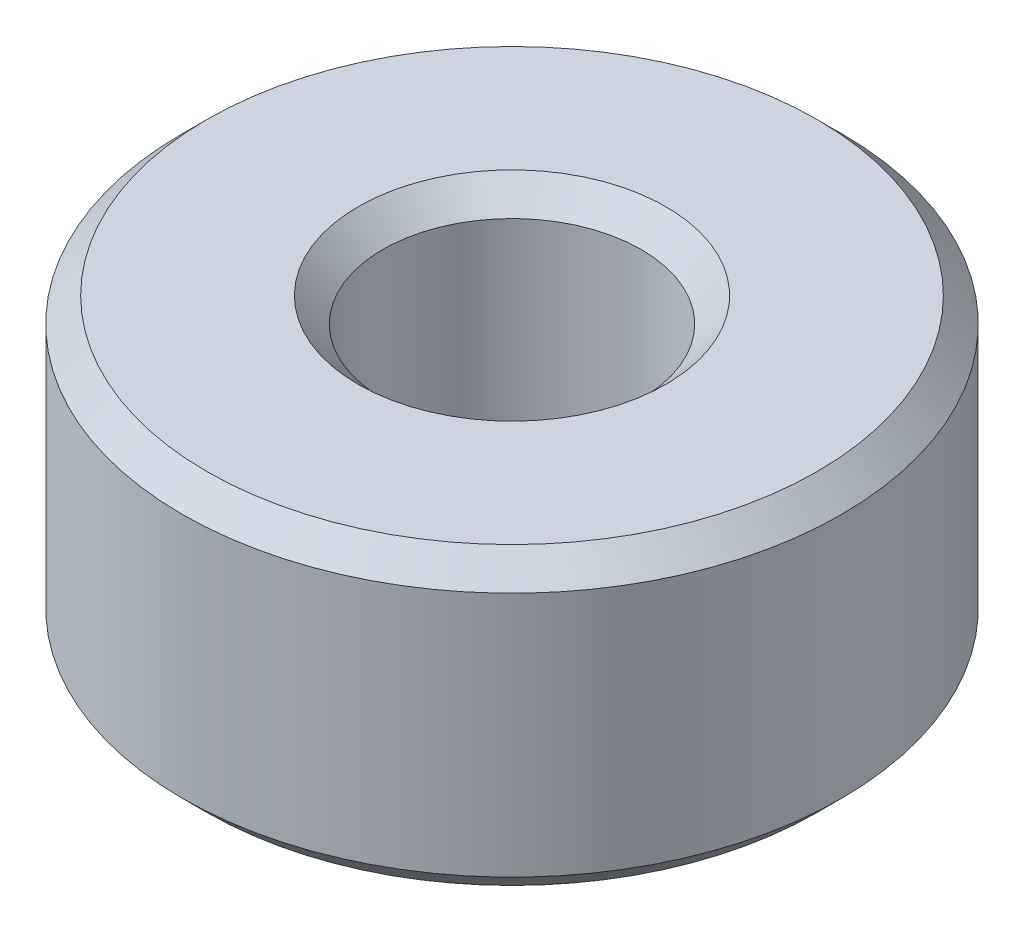
ISO-10303-21;
HEADER;
FILE_DESCRIPTION(('STEP AP214'),'2;1');
FILE_NAME('part.step','',(''),(''),'','','');
FILE_SCHEMA(('AUTOMOTIVE_DESIGN { 1 0 10303 214 1 1 1 1 }'));
ENDSEC;
DATA;
#1=APPLICATION_CONTEXT('core data for automotive mechanical design processes');
#2=APPLICATION_PROTOCOL_DEFINITION('international standard','automotive_design',2000,#1);
#3=PRODUCT_CONTEXT('',#1,'mechanical');
#4=PRODUCT('Part','Part','',(#3));
#5=PRODUCT_RELATED_PRODUCT_CATEGORY('part','',(#4));
#6=PRODUCT_DEFINITION_FORMATION('','',#4);
#7=PRODUCT_DEFINITION_CONTEXT('part definition',#1,'design');
#8=PRODUCT_DEFINITION('design','',#6,#7);
#9=PRODUCT_DEFINITION_SHAPE('','',#8);
#10=(LENGTH_UNIT() NAMED_UNIT(*) SI_UNIT(.MILLI.,.METRE.));
#11=(NAMED_UNIT(*) PLANE_ANGLE_UNIT() SI_UNIT($,.RADIAN.));
#12=(NAMED_UNIT(*) SI_UNIT($,.STERADIAN.) SOLID_ANGLE_UNIT());
#13=UNCERTAINTY_MEASURE_WITH_UNIT(LENGTH_MEASURE(1.E-05),#10,'distance_accuracy_value','');
#14=(GEOMETRIC_REPRESENTATION_CONTEXT(3) GLOBAL_UNCERTAINTY_ASSIGNED_CONTEXT((#13)) GLOBAL_UNIT_ASSIGNED_CONTEXT((#10,
#11,#12)) REPRESENTATION_CONTEXT('',''));
#15=CARTESIAN_POINT('',(0.,0.,0.));
#16=DIRECTION('',(0.,0.,1.));
#17=DIRECTION('',(1.,0.,0.));
#18=AXIS2_PLACEMENT_3D('',#15,#16,#17);
#19=CARTESIAN_POINT('',(0.,6.71642938309051,0.));
#20=DIRECTION('',(0.,-1.,0.));
#21=DIRECTION('',(0.,0.,-1.));
#22=AXIS2_PLACEMENT_3D('',#19,#20,#21);
#23=CYLINDRICAL_SURFACE('',#22,7.5);
#24=CARTESIAN_POINT('',(0.,0.561578965460436,0.));
#25=DIRECTION('',(0.,1.,0.));
#26=DIRECTION('',(0.,0.,1.));
#27=AXIS2_PLACEMENT_3D('',#24,#25,#26);
#28=CIRCLE('',#27,7.5);
#29=CARTESIAN_POINT('',(0.,0.561578965460436,7.5));
#30=VERTEX_POINT('',#29);
#31=EDGE_CURVE('E10',#30,#30,#28,.T.);
#32=ORIENTED_EDGE('',*,*,#31,.T.);
#33=EDGE_LOOP('',(#32));
#34=FACE_BOUND('',#33,.T.);
#35=CARTESIAN_POINT('',(0.,6.15485041763007,0.));
#36=DIRECTION('',(0.,1.,0.));
#37=DIRECTION('',(0.,0.,1.));
#38=AXIS2_PLACEMENT_3D('',#35,#36,#37);
#39=CIRCLE('',#38,7.5);
#40=CARTESIAN_POINT('',(0.,6.15485041763007,7.5));
#41=VERTEX_POINT('',#40);
#42=EDGE_CURVE('E50',#41,#41,#39,.F.);
#43=ORIENTED_EDGE('',*,*,#42,.T.);
#44=EDGE_LOOP('',(#43));
#45=FACE_BOUND('',#44,.T.);
#46=ADVANCED_FACE('F39',(#34,#45),#23,.T.);
#47=CARTESIAN_POINT('',(0.,6.71642938309051,0.));
#48=DIRECTION('',(0.,1.,0.));
#49=DIRECTION('',(0.,0.,1.));
#50=AXIS2_PLACEMENT_3D('',#47,#48,#49);
#51=PLANE('',#50);
#52=CARTESIAN_POINT('',(0.,6.71642938309051,0.));
#53=DIRECTION('',(0.,1.,0.));
#54=DIRECTION('',(0.,0.,1.));
#55=AXIS2_PLACEMENT_3D('',#52,#53,#54);
#56=CIRCLE('',#55,3.50099136209061);
#57=CARTESIAN_POINT('',(0.,6.71642938309051,3.50099136209061));
#58=VERTEX_POINT('',#57);
#59=EDGE_CURVE('E58',#58,#58,#56,.F.);
#60=ORIENTED_EDGE('',*,*,#59,.T.);
#61=EDGE_LOOP('',(#60));
#62=FACE_BOUND('',#61,.T.);
#63=CARTESIAN_POINT('',(0.,6.71642938309051,0.));
#64=DIRECTION('',(0.,1.,0.));
#65=DIRECTION('',(0.,0.,1.));
#66=AXIS2_PLACEMENT_3D('',#63,#64,#65);
#67=CIRCLE('',#66,6.93842103453956);
#68=CARTESIAN_POINT('',(0.,6.71642938309051,6.93842103453956));
#69=VERTEX_POINT('',#68);
#70=EDGE_CURVE('E61',#69,#69,#67,.T.);
#71=ORIENTED_EDGE('',*,*,#70,.T.);
#72=EDGE_LOOP('',(#71));
#73=FACE_BOUND('',#72,.T.);
#74=ADVANCED_FACE('F88',(#62,#73),#51,.T.);
#75=CARTESIAN_POINT('',(0.,0.,0.));
#76=DIRECTION('',(0.,1.,0.));
#77=DIRECTION('',(0.,0.,1.));
#78=AXIS2_PLACEMENT_3D('',#75,#76,#77);
#79=PLANE('',#78);
#80=CARTESIAN_POINT('',(0.,0.,0.));
#81=DIRECTION('',(0.,1.,0.));
#82=DIRECTION('',(0.,0.,1.));
#83=AXIS2_PLACEMENT_3D('',#80,#81,#82);
#84=CIRCLE('',#83,3.5009913620906);
#85=CARTESIAN_POINT('',(0.,0.,-3.5009913620906));
#86=VERTEX_POINT('',#85);
#87=EDGE_CURVE('E51',#86,#86,#84,.T.);
#88=ORIENTED_EDGE('',*,*,#87,.T.);
#89=EDGE_LOOP('',(#88));
#90=FACE_BOUND('',#89,.T.);
#91=CARTESIAN_POINT('',(0.,0.,0.));
#92=DIRECTION('',(0.,1.,0.));
#93=DIRECTION('',(0.,0.,1.));
#94=AXIS2_PLACEMENT_3D('',#91,#92,#93);
#95=CIRCLE('',#94,6.93842103453956);
#96=CARTESIAN_POINT('',(0.,0.,6.93842103453956));
#97=VERTEX_POINT('',#96);
#98=EDGE_CURVE('E54',#97,#97,#95,.F.);
#99=ORIENTED_EDGE('',*,*,#98,.T.);
#100=EDGE_LOOP('',(#99));
#101=FACE_BOUND('',#100,.T.);
#102=ADVANCED_FACE('F83',(#90,#101),#79,.F.);
#103=CARTESIAN_POINT('',(0.,6.71642938309051,0.));
#104=DIRECTION('',(0.,-1.,0.));
#105=DIRECTION('',(0.,0.,-1.));
#106=AXIS2_PLACEMENT_3D('',#103,#104,#105);
#107=CYLINDRICAL_SURFACE('',#106,2.93941239663017);
#108=CARTESIAN_POINT('',(0.,6.15485041763007,0.));
#109=DIRECTION('',(0.,1.,0.));
#110=DIRECTION('',(0.,0.,1.));
#111=AXIS2_PLACEMENT_3D('',#108,#109,#110);
#112=CIRCLE('',#111,2.93941239663017);
#113=CARTESIAN_POINT('',(0.,6.15485041763007,2.93941239663017));
#114=VERTEX_POINT('',#113);
#115=EDGE_CURVE('E67',#114,#114,#112,.T.);
#116=ORIENTED_EDGE('',*,*,#115,.T.);
#117=EDGE_LOOP('',(#116));
#118=FACE_BOUND('',#117,.T.);
#119=CARTESIAN_POINT('',(0.,0.561578965460442,0.));
#120=DIRECTION('',(0.,1.,0.));
#121=DIRECTION('',(0.,0.,1.));
#122=AXIS2_PLACEMENT_3D('',#119,#120,#121);
#123=CIRCLE('',#122,2.93941239663017);
#124=CARTESIAN_POINT('',(0.,0.561578965460442,-2.93941239663017));
#125=VERTEX_POINT('',#124);
#126=EDGE_CURVE('E69',#125,#125,#123,.F.);
#127=ORIENTED_EDGE('',*,*,#126,.T.);
#128=EDGE_LOOP('',(#127));
#129=FACE_BOUND('',#128,.T.);
#130=ADVANCED_FACE('F71',(#118,#129),#107,.F.);
#131=CARTESIAN_POINT('',(0.,6.15485041763007,0.));
#132=DIRECTION('',(0.,1.,0.));
#133=DIRECTION('',(0.,0.,1.));
#134=AXIS2_PLACEMENT_3D('',#131,#132,#133);
#135=CONICAL_SURFACE('',#134,2.93941239663017,0.78539816339745);
#136=ORIENTED_EDGE('',*,*,#59,.F.);
#137=EDGE_LOOP('',(#136));
#138=FACE_BOUND('',#137,.T.);
#139=ORIENTED_EDGE('',*,*,#115,.F.);
#140=EDGE_LOOP('',(#139));
#141=FACE_BOUND('',#140,.T.);
#142=ADVANCED_FACE('F77',(#138,#141),#135,.F.);
#143=CARTESIAN_POINT('',(0.,0.,0.));
#144=DIRECTION('',(0.,-1.,0.));
#145=DIRECTION('',(0.,0.,-1.));
#146=AXIS2_PLACEMENT_3D('',#143,#144,#145);
#147=CONICAL_SURFACE('',#146,3.5009913620906,0.785398163397443);
#148=CARTESIAN_POINT('',(0.,0.561578965460442,-2.93941239663017));
#149=CARTESIAN_POINT('',(0.,0.555729184570229,-2.94526217752038));
#150=CARTESIAN_POINT('',(0.,0.549879403680016,-2.95111195841059));
#151=CARTESIAN_POINT('',(0.,0.53817984189959,-2.96281152019102));
#152=CARTESIAN_POINT('',(0.,0.532330061009377,-2.96866130108123));
#153=CARTESIAN_POINT('',(0.,0.520630499228951,-2.98036086286166));
#154=CARTESIAN_POINT('',(0.,0.514780718338738,-2.98621064375187));
#155=CARTESIAN_POINT('',(0.,0.503081156558312,-2.9979102055323));
#156=CARTESIAN_POINT('',(0.,0.497231375668099,-3.00375998642251));
#157=CARTESIAN_POINT('',(0.,0.485531813887673,-3.01545954820293));
#158=CARTESIAN_POINT('',(0.,0.479682032997461,-3.02130932909315));
#159=CARTESIAN_POINT('',(0.,0.467982471217035,-3.03300889087357));
#160=CARTESIAN_POINT('',(0.,0.462132690326822,-3.03885867176379));
#161=CARTESIAN_POINT('',(0.,0.450433128546396,-3.05055823354421));
#162=CARTESIAN_POINT('',(0.,0.444583347656183,-3.05640801443443));
#163=CARTESIAN_POINT('',(0.,0.432883785875757,-3.06810757621485));
#164=CARTESIAN_POINT('',(0.,0.427034004985544,-3.07395735710506));
#165=CARTESIAN_POINT('',(0.,0.415334443205118,-3.08565691888549));
#166=CARTESIAN_POINT('',(0.,0.409484662314905,-3.0915066997757));
#167=CARTESIAN_POINT('',(0.,0.397785100534479,-3.10320626155613));
#168=CARTESIAN_POINT('',(0.,0.391935319644267,-3.10905604244634));
#169=CARTESIAN_POINT('',(0.,0.380235757863841,-3.12075560422677));
#170=CARTESIAN_POINT('',(0.,0.374385976973628,-3.12660538511698));
#171=CARTESIAN_POINT('',(0.,0.362686415193202,-3.13830494689741));
#172=CARTESIAN_POINT('',(0.,0.356836634302989,-3.14415472778762));
#173=CARTESIAN_POINT('',(0.,0.345137072522563,-3.15585428956804));
#174=CARTESIAN_POINT('',(0.,0.33928729163235,-3.16170407045826));
#175=CARTESIAN_POINT('',(0.,0.327587729851924,-3.17340363223868));
#176=CARTESIAN_POINT('',(0.,0.321737948961711,-3.1792534131289));
#177=CARTESIAN_POINT('',(0.,0.310038387181285,-3.19095297490932));
#178=CARTESIAN_POINT('',(0.,0.304188606291073,-3.19680275579953));
#179=CARTESIAN_POINT('',(0.,0.292489044510647,-3.20850231757996));
#180=CARTESIAN_POINT('',(0.,0.286639263620434,-3.21435209847017));
#181=CARTESIAN_POINT('',(0.,0.274939701840008,-3.2260516602506));
#182=CARTESIAN_POINT('',(0.,0.269089920949795,-3.23190144114081));
#183=CARTESIAN_POINT('',(0.,0.257390359169369,-3.24360100292124));
#184=CARTESIAN_POINT('',(0.,0.251540578279156,-3.24945078381145));
#185=CARTESIAN_POINT('',(0.,0.23984101649873,-3.26115034559188));
#186=CARTESIAN_POINT('',(0.,0.233991235608517,-3.26700012648209));
#187=CARTESIAN_POINT('',(0.,0.222291673828091,-3.27869968826251));
#188=CARTESIAN_POINT('',(0.,0.216441892937879,-3.28454946915273));
#189=CARTESIAN_POINT('',(0.,0.204742331157453,-3.29624903093315));
#190=CARTESIAN_POINT('',(0.,0.19889255026724,-3.30209881182337));
#191=CARTESIAN_POINT('',(0.,0.187192988486814,-3.31379837360379));
#192=CARTESIAN_POINT('',(0.,0.181343207596601,-3.319648154494));
#193=CARTESIAN_POINT('',(0.,0.169643645816175,-3.33134771627443));
#194=CARTESIAN_POINT('',(0.,0.163793864925962,-3.33719749716464));
#195=CARTESIAN_POINT('',(0.,0.152094303145536,-3.34889705894507));
#196=CARTESIAN_POINT('',(0.,0.146244522255323,-3.35474683983528));
#197=CARTESIAN_POINT('',(0.,0.134544960474897,-3.36644640161571));
#198=CARTESIAN_POINT('',(0.,0.128695179584685,-3.37229618250592));
#199=CARTESIAN_POINT('',(0.,0.116995617804259,-3.38399574428635));
#200=CARTESIAN_POINT('',(0.,0.111145836914046,-3.38984552517656));
#201=CARTESIAN_POINT('',(0.,0.0994462751336198,-3.40154508695698));
#202=CARTESIAN_POINT('',(0.,0.0935964942434069,-3.4073948678472));
#203=CARTESIAN_POINT('',(0.,0.0818969324629811,-3.41909442962762));
#204=CARTESIAN_POINT('',(0.,0.0760471515727682,-3.42494421051784));
#205=CARTESIAN_POINT('',(0.,0.0643475897923423,-3.43664377229826));
#206=CARTESIAN_POINT('',(0.,0.0584978089021293,-3.44249355318847));
#207=CARTESIAN_POINT('',(0.,0.0467982471217034,-3.4541931149689));
#208=CARTESIAN_POINT('',(0.,0.0409484662314905,-3.46004289585911));
#209=CARTESIAN_POINT('',(0.,0.0292489044510647,-3.47174245763954));
#210=CARTESIAN_POINT('',(0.,0.0233991235608517,-3.47759223852975));
#211=CARTESIAN_POINT('',(0.,0.0116995617804258,-3.48929180031018));
#212=CARTESIAN_POINT('',(0.,0.00584978089021283,-3.49514158120039));
#213=CARTESIAN_POINT('',(0.,0.,-3.5009913620906));
#214=B_SPLINE_CURVE_WITH_KNOTS('',3,(#148,#149,#150,#151,#152,#153,#154,#155,#156,#157,#158,
#159,#160,#161,#162,#163,#164,#165,#166,#167,#168,#169,#170,#171,#172,#173,#174,#175,#176,#177,
#178,#179,#180,#181,#182,#183,#184,#185,#186,#187,#188,#189,#190,#191,#192,#193,#194,#195,#196,
#197,#198,#199,#200,#201,#202,#203,#204,#205,#206,#207,#208,#209,#210,#211,#212,#213),
.UNSPECIFIED.,.F.,.F.,(4,2,2,2,2,2,2,2,2,2,2,2,2,2,2,2,2,2,2,2,2,2,2,2,2,2,2,2,2,2,2,2,4),(0.,
0.0248185184155499,0.0496370368311002,0.0744555552466505,0.0992740736622004,0.124092592077751,
0.148911110493301,0.173729628908851,0.198548147324401,0.223366665739951,0.248185184155501,
0.273003702571051,0.297822220986601,0.322640739402151,0.347459257817702,0.372277776233252,
0.397096294648802,0.421914813064352,0.446733331479902,0.471551849895452,0.496370368311002,
0.521188886726552,0.546007405142103,0.570825923557653,0.595644441973203,0.620462960388753,
0.645281478804303,0.670099997219853,0.694918515635404,0.719737034050953,0.744555552466504,
0.769374070882054,0.794192589297604),.UNSPECIFIED.);
#215=EDGE_CURVE('BSEAM73',#125,#86,#214,.T.);
#216=ORIENTED_EDGE('',*,*,#126,.F.);
#217=ORIENTED_EDGE('',*,*,#87,.F.);
#218=ORIENTED_EDGE('',*,*,#215,.T.);
#219=ORIENTED_EDGE('',*,*,#215,.F.);
#220=EDGE_LOOP('',(#216,#218,#217,#219));
#221=FACE_BOUND('',#220,.T.);
#222=ADVANCED_FACE('F73',(#221),#147,.F.);
#223=CARTESIAN_POINT('',(0.,0.561578965460436,0.));
#224=DIRECTION('',(0.,1.,0.));
#225=DIRECTION('',(0.,0.,1.));
#226=AXIS2_PLACEMENT_3D('',#223,#224,#225);
#227=CONICAL_SURFACE('',#226,7.5,0.785398163397453);
#228=ORIENTED_EDGE('',*,*,#98,.F.);
#229=EDGE_LOOP('',(#228));
#230=FACE_BOUND('',#229,.T.);
#231=ORIENTED_EDGE('',*,*,#31,.F.);
#232=EDGE_LOOP('',(#231));
#233=FACE_BOUND('',#232,.T.);
#234=ADVANCED_FACE('F76',(#230,#233),#227,.T.);
#235=CARTESIAN_POINT('',(0.,6.71642938309051,0.));
#236=DIRECTION('',(0.,-1.,0.));
#237=DIRECTION('',(0.,0.,-1.));
#238=AXIS2_PLACEMENT_3D('',#235,#236,#237);
#239=CONICAL_SURFACE('',#238,6.93842103453956,0.785398163397447);
#240=ORIENTED_EDGE('',*,*,#42,.F.);
#241=EDGE_LOOP('',(#240));
#242=FACE_BOUND('',#241,.T.);
#243=ORIENTED_EDGE('',*,*,#70,.F.);
#244=EDGE_LOOP('',(#243));
#245=FACE_BOUND('',#244,.T.);
#246=ADVANCED_FACE('F45',(#242,#245),#239,.T.);
#247=CLOSED_SHELL('',(#46,#74,#102,#130,#142,#222,#234,#246));
#248=MANIFOLD_SOLID_BREP('B2',#247);
#249=ADVANCED_BREP_SHAPE_REPRESENTATION('',(#18,#248),#14);
#250=SHAPE_DEFINITION_REPRESENTATION(#9,#249);
ENDSEC;
END-ISO-10303-21;
